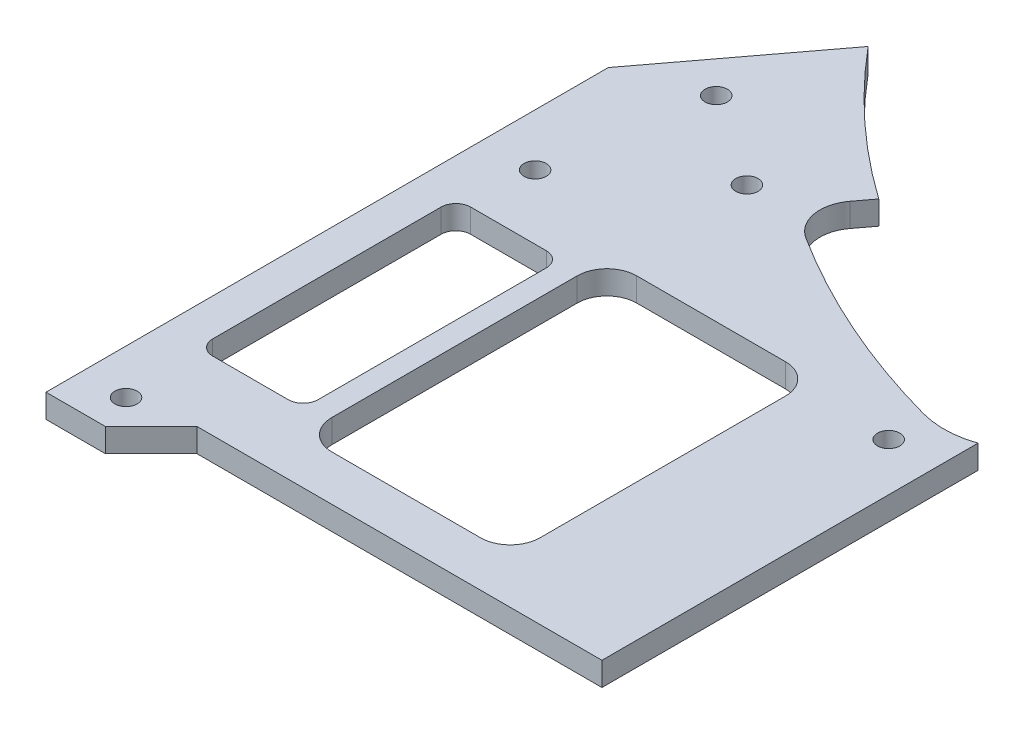
ISO-10303-21;
HEADER;
FILE_DESCRIPTION(('STEP AP214'),'2;1');
FILE_NAME('part.step','',(''),(''),'','','');
FILE_SCHEMA(('AUTOMOTIVE_DESIGN { 1 0 10303 214 1 1 1 1 }'));
ENDSEC;
DATA;
#1=APPLICATION_CONTEXT('core data for automotive mechanical design processes');
#2=APPLICATION_PROTOCOL_DEFINITION('international standard','automotive_design',2000,#1);
#3=PRODUCT_CONTEXT('',#1,'mechanical');
#4=PRODUCT('Part','Part','',(#3));
#5=PRODUCT_RELATED_PRODUCT_CATEGORY('part','',(#4));
#6=PRODUCT_DEFINITION_FORMATION('','',#4);
#7=PRODUCT_DEFINITION_CONTEXT('part definition',#1,'design');
#8=PRODUCT_DEFINITION('design','',#6,#7);
#9=PRODUCT_DEFINITION_SHAPE('','',#8);
#10=(LENGTH_UNIT() NAMED_UNIT(*) SI_UNIT(.MILLI.,.METRE.));
#11=(NAMED_UNIT(*) PLANE_ANGLE_UNIT() SI_UNIT($,.RADIAN.));
#12=(NAMED_UNIT(*) SI_UNIT($,.STERADIAN.) SOLID_ANGLE_UNIT());
#13=UNCERTAINTY_MEASURE_WITH_UNIT(LENGTH_MEASURE(1.E-05),#10,'distance_accuracy_value','');
#14=(GEOMETRIC_REPRESENTATION_CONTEXT(3) GLOBAL_UNCERTAINTY_ASSIGNED_CONTEXT((#13)) GLOBAL_UNIT_ASSIGNED_CONTEXT((#10,
#11,#12)) REPRESENTATION_CONTEXT('',''));
#15=CARTESIAN_POINT('',(0.,0.,0.));
#16=DIRECTION('',(0.,0.,1.));
#17=DIRECTION('',(1.,0.,0.));
#18=AXIS2_PLACEMENT_3D('',#15,#16,#17);
#19=CARTESIAN_POINT('',(0.,36.,0.));
#20=DIRECTION('',(0.,1.,0.));
#21=DIRECTION('',(0.,0.,1.));
#22=AXIS2_PLACEMENT_3D('',#19,#20,#21);
#23=PLANE('',#22);
#24=DIRECTION('',(0.,0.,1.));
#25=VECTOR('',#24,1.);
#26=CARTESIAN_POINT('',(-20.5761915158073,36.,-84.0401600450592));
#27=LINE('',#26,#25);
#28=CARTESIAN_POINT('',(-20.5761915158073,36.,100.640470308775));
#29=VERTEX_POINT('',#28);
#30=CARTESIAN_POINT('',(-20.5761915158073,36.,151.2));
#31=VERTEX_POINT('',#30);
#32=EDGE_CURVE('E219',#29,#31,#27,.T.);
#33=ORIENTED_EDGE('',*,*,#32,.F.);
#34=CARTESIAN_POINT('',(-24.5,36.,89.3001119820127));
#35=DIRECTION('',(0.,1.,0.));
#36=DIRECTION('',(0.,0.,-1.));
#37=AXIS2_PLACEMENT_3D('',#34,#35,#36);
#38=CIRCLE('',#37,12.);
#39=CARTESIAN_POINT('',(-27.6749460043196,36.,100.872480705383));
#40=VERTEX_POINT('',#39);
#41=EDGE_CURVE('E230',#40,#29,#38,.T.);
#42=ORIENTED_EDGE('',*,*,#41,.F.);
#43=CARTESIAN_POINT('',(4.66779392915839E-11,36.,-1.10508824313627E-10));
#44=DIRECTION('',(0.,1.,0.));
#45=DIRECTION('',(0.,0.,1.));
#46=AXIS2_PLACEMENT_3D('',#43,#44,#45);
#47=CIRCLE('',#46,104.600000000119);
#48=CARTESIAN_POINT('',(-56.0366408541975,36.,88.3235805534269));
#49=VERTEX_POINT('',#48);
#50=EDGE_CURVE('E239',#49,#40,#47,.T.);
#51=ORIENTED_EDGE('',*,*,#50,.F.);
#52=CARTESIAN_POINT('',(-53.3580251345896,36.,84.1016120757296));
#53=DIRECTION('',(0.,1.,0.));
#54=DIRECTION('',(0.,0.,1.));
#55=AXIS2_PLACEMENT_3D('',#52,#53,#54);
#56=CIRCLE('',#55,5.);
#57=CARTESIAN_POINT('',(-57.3512026848261,36.,81.0925369599694));
#58=VERTEX_POINT('',#57);
#59=EDGE_CURVE('E245',#58,#49,#56,.T.);
#60=ORIENTED_EDGE('',*,*,#59,.F.);
#61=DIRECTION('',(-0.601815023152044,0.,0.798635510047296));
#62=VECTOR('',#61,1.);
#63=CARTESIAN_POINT('',(-21.4931775502365,36.,33.5073303915772));
#64=LINE('',#63,#62);
#65=CARTESIAN_POINT('',(-55.6815943466689,36.,78.8768918606836));
#66=VERTEX_POINT('',#65);
#67=EDGE_CURVE('E263',#66,#58,#64,.T.);
#68=ORIENTED_EDGE('',*,*,#67,.F.);
#69=CARTESIAN_POINT('',(0.,36.,0.));
#70=DIRECTION('',(0.,1.,0.));
#71=DIRECTION('',(0.,0.,1.));
#72=AXIS2_PLACEMENT_3D('',#69,#70,#71);
#73=CIRCLE('',#72,96.550525729221);
#74=CARTESIAN_POINT('',(-74.1470081851936,36.,61.8403201461135));
#75=VERTEX_POINT('',#74);
#76=EDGE_CURVE('E64',#75,#66,#73,.T.);
#77=ORIENTED_EDGE('',*,*,#76,.F.);
#78=DIRECTION('',(-0.601815023152044,0.,0.798635510047296));
#79=VECTOR('',#78,1.);
#80=CARTESIAN_POINT('',(-17.5699812210405,36.,-13.239930509345));
#81=LINE('',#80,#79);
#82=CARTESIAN_POINT('',(-89.1600000000001,36.,81.7632331909823));
#83=VERTEX_POINT('',#82);
#84=EDGE_CURVE('E304',#75,#83,#81,.T.);
#85=ORIENTED_EDGE('',*,*,#84,.T.);
#86=DIRECTION('',(0.,0.,1.));
#87=VECTOR('',#86,1.);
#88=CARTESIAN_POINT('',(-89.1600000000001,36.,81.7632331909823));
#89=LINE('',#88,#87);
#90=CARTESIAN_POINT('',(-89.1600000000001,36.,157.357359312881));
#91=VERTEX_POINT('',#90);
#92=EDGE_CURVE('E307',#83,#91,#89,.T.);
#93=ORIENTED_EDGE('',*,*,#92,.T.);
#94=DIRECTION('',(1.,0.,0.));
#95=VECTOR('',#94,1.);
#96=CARTESIAN_POINT('',(-89.1600000000001,36.,157.357359312881));
#97=LINE('',#96,#95);
#98=CARTESIAN_POINT('',(-81.1894372515229,36.,157.357359312881));
#99=VERTEX_POINT('',#98);
#100=EDGE_CURVE('E311',#91,#99,#97,.T.);
#101=ORIENTED_EDGE('',*,*,#100,.T.);
#102=DIRECTION('',(0.707106781186546,0.,-0.707106781186549));
#103=VECTOR('',#102,1.);
#104=CARTESIAN_POINT('',(-81.1894372515229,36.,157.357359312881));
#105=LINE('',#104,#103);
#106=CARTESIAN_POINT('',(-75.0320779386422,36.,151.2));
#107=VERTEX_POINT('',#106);
#108=EDGE_CURVE('E314',#99,#107,#105,.T.);
#109=ORIENTED_EDGE('',*,*,#108,.T.);
#110=DIRECTION('',(1.,0.,0.));
#111=VECTOR('',#110,1.);
#112=CARTESIAN_POINT('',(-75.0320779386422,36.,151.2));
#113=LINE('',#112,#111);
#114=EDGE_CURVE('E232',#107,#31,#113,.T.);
#115=ORIENTED_EDGE('',*,*,#114,.T.);
#116=EDGE_LOOP('',(#33,#42,#51,#60,#68,#77,#85,#93,#101,#109,#115));
#117=FACE_BOUND('',#116,.T.);
#118=CARTESIAN_POINT('',(-82.16,36.,98.6));
#119=DIRECTION('',(0.,1.,0.));
#120=DIRECTION('',(0.,0.,1.));
#121=AXIS2_PLACEMENT_3D('',#118,#119,#120);
#122=CIRCLE('',#121,1.5);
#123=CARTESIAN_POINT('',(-82.16,36.,100.1));
#124=VERTEX_POINT('',#123);
#125=EDGE_CURVE('E577',#124,#124,#122,.T.);
#126=ORIENTED_EDGE('',*,*,#125,.F.);
#127=EDGE_LOOP('',(#126));
#128=FACE_BOUND('',#127,.T.);
#129=CARTESIAN_POINT('',(-66.171704332278,36.,86.1119361398964));
#130=DIRECTION('',(0.,1.,0.));
#131=DIRECTION('',(0.,0.,1.));
#132=AXIS2_PLACEMENT_3D('',#129,#130,#131);
#133=CIRCLE('',#132,1.5);
#134=CARTESIAN_POINT('',(-66.171704332278,36.,87.6119361398964));
#135=VERTEX_POINT('',#134);
#136=EDGE_CURVE('E572',#135,#135,#133,.T.);
#137=ORIENTED_EDGE('',*,*,#136,.F.);
#138=EDGE_LOOP('',(#137));
#139=FACE_BOUND('',#138,.T.);
#140=DIRECTION('',(0.,0.,1.));
#141=VECTOR('',#140,1.);
#142=CARTESIAN_POINT('',(-67.,36.,104.1));
#143=LINE('',#142,#141);
#144=CARTESIAN_POINT('',(-67.,36.,108.1));
#145=VERTEX_POINT('',#144);
#146=CARTESIAN_POINT('',(-67.,36.,141.1));
#147=VERTEX_POINT('',#146);
#148=EDGE_CURVE('E478',#145,#147,#143,.T.);
#149=ORIENTED_EDGE('',*,*,#148,.F.);
#150=CARTESIAN_POINT('',(-63.,36.,108.1));
#151=DIRECTION('',(0.,1.,0.));
#152=DIRECTION('',(0.,0.,1.));
#153=AXIS2_PLACEMENT_3D('',#150,#151,#152);
#154=CIRCLE('',#153,4.);
#155=CARTESIAN_POINT('',(-63.,36.,104.1));
#156=VERTEX_POINT('',#155);
#157=EDGE_CURVE('E447',#145,#156,#154,.F.);
#158=ORIENTED_EDGE('',*,*,#157,.T.);
#159=DIRECTION('',(-1.,0.,0.));
#160=VECTOR('',#159,1.);
#161=CARTESIAN_POINT('',(-67.,36.,104.1));
#162=LINE('',#161,#160);
#163=CARTESIAN_POINT('',(-43.,36.,104.1));
#164=VERTEX_POINT('',#163);
#165=EDGE_CURVE('E472',#164,#156,#162,.T.);
#166=ORIENTED_EDGE('',*,*,#165,.F.);
#167=CARTESIAN_POINT('',(-43.,36.,108.1));
#168=DIRECTION('',(0.,1.,0.));
#169=DIRECTION('',(0.,0.,1.));
#170=AXIS2_PLACEMENT_3D('',#167,#168,#169);
#171=CIRCLE('',#170,4.);
#172=CARTESIAN_POINT('',(-39.,36.,108.1));
#173=VERTEX_POINT('',#172);
#174=EDGE_CURVE('E441',#164,#173,#171,.F.);
#175=ORIENTED_EDGE('',*,*,#174,.T.);
#176=DIRECTION('',(0.,0.,-1.));
#177=VECTOR('',#176,1.);
#178=CARTESIAN_POINT('',(-39.,36.,104.1));
#179=LINE('',#178,#177);
#180=CARTESIAN_POINT('',(-39.,36.,141.1));
#181=VERTEX_POINT('',#180);
#182=EDGE_CURVE('E483',#181,#173,#179,.T.);
#183=ORIENTED_EDGE('',*,*,#182,.F.);
#184=CARTESIAN_POINT('',(-43.,36.,141.1));
#185=DIRECTION('',(0.,1.,0.));
#186=DIRECTION('',(0.,0.,1.));
#187=AXIS2_PLACEMENT_3D('',#184,#185,#186);
#188=CIRCLE('',#187,4.);
#189=CARTESIAN_POINT('',(-43.,36.,145.1));
#190=VERTEX_POINT('',#189);
#191=EDGE_CURVE('E429',#181,#190,#188,.F.);
#192=ORIENTED_EDGE('',*,*,#191,.T.);
#193=DIRECTION('',(1.,0.,0.));
#194=VECTOR('',#193,1.);
#195=CARTESIAN_POINT('',(-67.,36.,145.1));
#196=LINE('',#195,#194);
#197=CARTESIAN_POINT('',(-63.,36.,145.1));
#198=VERTEX_POINT('',#197);
#199=EDGE_CURVE('E487',#198,#190,#196,.T.);
#200=ORIENTED_EDGE('',*,*,#199,.F.);
#201=CARTESIAN_POINT('',(-63.,36.,141.1));
#202=DIRECTION('',(0.,1.,0.));
#203=DIRECTION('',(0.,0.,1.));
#204=AXIS2_PLACEMENT_3D('',#201,#202,#203);
#205=CIRCLE('',#204,4.);
#206=EDGE_CURVE('E435',#198,#147,#205,.F.);
#207=ORIENTED_EDGE('',*,*,#206,.T.);
#208=EDGE_LOOP('',(#149,#158,#166,#175,#183,#192,#200,#207));
#209=FACE_BOUND('',#208,.T.);
#210=CARTESIAN_POINT('',(-78.6387322233556,36.,77.7708801178395));
#211=DIRECTION('',(0.,1.,0.));
#212=DIRECTION('',(0.,0.,1.));
#213=AXIS2_PLACEMENT_3D('',#210,#211,#212);
#214=CIRCLE('',#213,1.5);
#215=CARTESIAN_POINT('',(-78.6387322233556,36.,79.2708801178395));
#216=VERTEX_POINT('',#215);
#217=EDGE_CURVE('E496',#216,#216,#214,.T.);
#218=ORIENTED_EDGE('',*,*,#217,.F.);
#219=EDGE_LOOP('',(#218));
#220=FACE_BOUND('',#219,.T.);
#221=CARTESIAN_POINT('',(-83.1600000000001,36.,152.6));
#222=DIRECTION('',(0.,1.,0.));
#223=DIRECTION('',(0.,0.,1.));
#224=AXIS2_PLACEMENT_3D('',#221,#222,#223);
#225=CIRCLE('',#224,1.5);
#226=CARTESIAN_POINT('',(-83.1600000000001,36.,154.1));
#227=VERTEX_POINT('',#226);
#228=EDGE_CURVE('E495',#227,#227,#225,.T.);
#229=ORIENTED_EDGE('',*,*,#228,.F.);
#230=EDGE_LOOP('',(#229));
#231=FACE_BOUND('',#230,.T.);
#232=CARTESIAN_POINT('',(-27.,36.,106.222219897722));
#233=DIRECTION('',(0.,1.,0.));
#234=DIRECTION('',(0.,0.,1.));
#235=AXIS2_PLACEMENT_3D('',#232,#233,#234);
#236=CIRCLE('',#235,1.5);
#237=CARTESIAN_POINT('',(-27.,36.,107.722219897722));
#238=VERTEX_POINT('',#237);
#239=EDGE_CURVE('E503',#238,#238,#236,.T.);
#240=ORIENTED_EDGE('',*,*,#239,.F.);
#241=EDGE_LOOP('',(#240));
#242=FACE_BOUND('',#241,.T.);
#243=DIRECTION('',(1.,0.,0.));
#244=VECTOR('',#243,1.);
#245=CARTESIAN_POINT('',(-84.16,36.,141.946640511851));
#246=LINE('',#245,#244);
#247=CARTESIAN_POINT('',(-82.16,36.,141.946640511851));
#248=VERTEX_POINT('',#247);
#249=CARTESIAN_POINT('',(-72.,36.,141.946640511851));
#250=VERTEX_POINT('',#249);
#251=EDGE_CURVE('E276',#248,#250,#246,.T.);
#252=ORIENTED_EDGE('',*,*,#251,.F.);
#253=CARTESIAN_POINT('',(-82.16,36.,139.946640511851));
#254=DIRECTION('',(0.,1.,0.));
#255=DIRECTION('',(0.,0.,1.));
#256=AXIS2_PLACEMENT_3D('',#253,#254,#255);
#257=CIRCLE('',#256,2.);
#258=CARTESIAN_POINT('',(-84.16,36.,139.946640511851));
#259=VERTEX_POINT('',#258);
#260=EDGE_CURVE('E386',#248,#259,#257,.F.);
#261=ORIENTED_EDGE('',*,*,#260,.T.);
#262=DIRECTION('',(0.,0.,1.));
#263=VECTOR('',#262,1.);
#264=CARTESIAN_POINT('',(-84.16,36.,107.253359488149));
#265=LINE('',#264,#263);
#266=CARTESIAN_POINT('',(-84.16,36.,109.253359488149));
#267=VERTEX_POINT('',#266);
#268=EDGE_CURVE('E272',#267,#259,#265,.T.);
#269=ORIENTED_EDGE('',*,*,#268,.F.);
#270=CARTESIAN_POINT('',(-82.16,36.,109.253359488149));
#271=DIRECTION('',(0.,1.,0.));
#272=DIRECTION('',(0.,0.,1.));
#273=AXIS2_PLACEMENT_3D('',#270,#271,#272);
#274=CIRCLE('',#273,2.);
#275=CARTESIAN_POINT('',(-82.16,36.,107.253359488149));
#276=VERTEX_POINT('',#275);
#277=EDGE_CURVE('E392',#267,#276,#274,.F.);
#278=ORIENTED_EDGE('',*,*,#277,.T.);
#279=DIRECTION('',(-1.,0.,0.));
#280=VECTOR('',#279,1.);
#281=CARTESIAN_POINT('',(-70.,36.,107.253359488149));
#282=LINE('',#281,#280);
#283=CARTESIAN_POINT('',(-72.,36.,107.253359488149));
#284=VERTEX_POINT('',#283);
#285=EDGE_CURVE('E285',#284,#276,#282,.T.);
#286=ORIENTED_EDGE('',*,*,#285,.F.);
#287=CARTESIAN_POINT('',(-72.,36.,109.253359488149));
#288=DIRECTION('',(0.,1.,0.));
#289=DIRECTION('',(0.,0.,1.));
#290=AXIS2_PLACEMENT_3D('',#287,#288,#289);
#291=CIRCLE('',#290,2.);
#292=CARTESIAN_POINT('',(-70.,36.,109.253359488149));
#293=VERTEX_POINT('',#292);
#294=EDGE_CURVE('E398',#284,#293,#291,.F.);
#295=ORIENTED_EDGE('',*,*,#294,.T.);
#296=DIRECTION('',(0.,0.,-1.));
#297=VECTOR('',#296,1.);
#298=CARTESIAN_POINT('',(-70.,36.,141.946640511851));
#299=LINE('',#298,#297);
#300=CARTESIAN_POINT('',(-70.,36.,139.946640511851));
#301=VERTEX_POINT('',#300);
#302=EDGE_CURVE('E281',#301,#293,#299,.T.);
#303=ORIENTED_EDGE('',*,*,#302,.F.);
#304=CARTESIAN_POINT('',(-72.,36.,139.946640511851));
#305=DIRECTION('',(0.,1.,0.));
#306=DIRECTION('',(0.,0.,1.));
#307=AXIS2_PLACEMENT_3D('',#304,#305,#306);
#308=CIRCLE('',#307,2.);
#309=EDGE_CURVE('E380',#301,#250,#308,.F.);
#310=ORIENTED_EDGE('',*,*,#309,.T.);
#311=EDGE_LOOP('',(#252,#261,#269,#278,#286,#295,#303,#310));
#312=FACE_BOUND('',#311,.T.);
#313=ADVANCED_FACE('F41',(#117,#128,#139,#209,#220,#231,#242,#312),#23,.T.);
#314=CARTESIAN_POINT('',(0.,32.825,0.));
#315=DIRECTION('',(0.,1.,0.));
#316=DIRECTION('',(0.,0.,1.));
#317=AXIS2_PLACEMENT_3D('',#314,#315,#316);
#318=PLANE('',#317);
#319=CARTESIAN_POINT('',(-82.16,32.825,98.6));
#320=DIRECTION('',(0.,1.,0.));
#321=DIRECTION('',(0.,0.,1.));
#322=AXIS2_PLACEMENT_3D('',#319,#320,#321);
#323=CIRCLE('',#322,1.5);
#324=CARTESIAN_POINT('',(-82.16,32.825,100.1));
#325=VERTEX_POINT('',#324);
#326=EDGE_CURVE('E573',#325,#325,#323,.T.);
#327=ORIENTED_EDGE('',*,*,#326,.T.);
#328=EDGE_LOOP('',(#327));
#329=FACE_BOUND('',#328,.T.);
#330=CARTESIAN_POINT('',(-66.171704332278,32.825,86.1119361398964));
#331=DIRECTION('',(0.,1.,0.));
#332=DIRECTION('',(0.,0.,1.));
#333=AXIS2_PLACEMENT_3D('',#330,#331,#332);
#334=CIRCLE('',#333,1.5);
#335=CARTESIAN_POINT('',(-66.171704332278,32.825,87.6119361398964));
#336=VERTEX_POINT('',#335);
#337=EDGE_CURVE('E581',#336,#336,#334,.T.);
#338=ORIENTED_EDGE('',*,*,#337,.T.);
#339=EDGE_LOOP('',(#338));
#340=FACE_BOUND('',#339,.T.);
#341=DIRECTION('',(0.,0.,-1.));
#342=VECTOR('',#341,1.);
#343=CARTESIAN_POINT('',(-39.,32.825,104.1));
#344=LINE('',#343,#342);
#345=CARTESIAN_POINT('',(-39.,32.825,141.1));
#346=VERTEX_POINT('',#345);
#347=CARTESIAN_POINT('',(-39.,32.825,108.1));
#348=VERTEX_POINT('',#347);
#349=EDGE_CURVE('E591',#346,#348,#344,.T.);
#350=ORIENTED_EDGE('',*,*,#349,.T.);
#351=CARTESIAN_POINT('',(-43.,32.825,108.1));
#352=DIRECTION('',(0.,1.,0.));
#353=DIRECTION('',(0.,0.,1.));
#354=AXIS2_PLACEMENT_3D('',#351,#352,#353);
#355=CIRCLE('',#354,4.);
#356=CARTESIAN_POINT('',(-43.,32.825,104.1));
#357=VERTEX_POINT('',#356);
#358=EDGE_CURVE('E444',#348,#357,#355,.T.);
#359=ORIENTED_EDGE('',*,*,#358,.T.);
#360=DIRECTION('',(-1.,0.,0.));
#361=VECTOR('',#360,1.);
#362=CARTESIAN_POINT('',(-67.,32.825,104.1));
#363=LINE('',#362,#361);
#364=CARTESIAN_POINT('',(-63.,32.825,104.1));
#365=VERTEX_POINT('',#364);
#366=EDGE_CURVE('E461',#357,#365,#363,.T.);
#367=ORIENTED_EDGE('',*,*,#366,.T.);
#368=CARTESIAN_POINT('',(-63.,32.825,108.1));
#369=DIRECTION('',(0.,1.,0.));
#370=DIRECTION('',(0.,0.,1.));
#371=AXIS2_PLACEMENT_3D('',#368,#369,#370);
#372=CIRCLE('',#371,4.);
#373=CARTESIAN_POINT('',(-67.,32.825,108.1));
#374=VERTEX_POINT('',#373);
#375=EDGE_CURVE('E50',#365,#374,#372,.T.);
#376=ORIENTED_EDGE('',*,*,#375,.T.);
#377=DIRECTION('',(0.,0.,1.));
#378=VECTOR('',#377,1.);
#379=CARTESIAN_POINT('',(-67.,32.825,104.1));
#380=LINE('',#379,#378);
#381=CARTESIAN_POINT('',(-67.,32.825,141.1));
#382=VERTEX_POINT('',#381);
#383=EDGE_CURVE('E458',#374,#382,#380,.T.);
#384=ORIENTED_EDGE('',*,*,#383,.T.);
#385=CARTESIAN_POINT('',(-63.,32.825,141.1));
#386=DIRECTION('',(0.,1.,0.));
#387=DIRECTION('',(0.,0.,1.));
#388=AXIS2_PLACEMENT_3D('',#385,#386,#387);
#389=CIRCLE('',#388,4.);
#390=CARTESIAN_POINT('',(-63.,32.825,145.1));
#391=VERTEX_POINT('',#390);
#392=EDGE_CURVE('E438',#382,#391,#389,.T.);
#393=ORIENTED_EDGE('',*,*,#392,.T.);
#394=DIRECTION('',(1.,0.,0.));
#395=VECTOR('',#394,1.);
#396=CARTESIAN_POINT('',(-67.,32.825,145.1));
#397=LINE('',#396,#395);
#398=CARTESIAN_POINT('',(-43.,32.825,145.1));
#399=VERTEX_POINT('',#398);
#400=EDGE_CURVE('E471',#391,#399,#397,.T.);
#401=ORIENTED_EDGE('',*,*,#400,.T.);
#402=CARTESIAN_POINT('',(-43.,32.825,141.1));
#403=DIRECTION('',(0.,1.,0.));
#404=DIRECTION('',(0.,0.,1.));
#405=AXIS2_PLACEMENT_3D('',#402,#403,#404);
#406=CIRCLE('',#405,4.);
#407=EDGE_CURVE('E432',#399,#346,#406,.T.);
#408=ORIENTED_EDGE('',*,*,#407,.T.);
#409=EDGE_LOOP('',(#350,#359,#367,#376,#384,#393,#401,#408));
#410=FACE_BOUND('',#409,.T.);
#411=CARTESIAN_POINT('',(-78.6387322233556,32.825,77.7708801178395));
#412=DIRECTION('',(0.,1.,0.));
#413=DIRECTION('',(0.,0.,1.));
#414=AXIS2_PLACEMENT_3D('',#411,#412,#413);
#415=CIRCLE('',#414,1.5);
#416=CARTESIAN_POINT('',(-78.6387322233556,32.825,79.2708801178395));
#417=VERTEX_POINT('',#416);
#418=EDGE_CURVE('E491',#417,#417,#415,.T.);
#419=ORIENTED_EDGE('',*,*,#418,.T.);
#420=EDGE_LOOP('',(#419));
#421=FACE_BOUND('',#420,.T.);
#422=CARTESIAN_POINT('',(-83.1600000000001,32.825,152.6));
#423=DIRECTION('',(0.,1.,0.));
#424=DIRECTION('',(0.,0.,1.));
#425=AXIS2_PLACEMENT_3D('',#422,#423,#424);
#426=CIRCLE('',#425,1.5);
#427=CARTESIAN_POINT('',(-83.1600000000001,32.825,154.1));
#428=VERTEX_POINT('',#427);
#429=EDGE_CURVE('E507',#428,#428,#426,.T.);
#430=ORIENTED_EDGE('',*,*,#429,.T.);
#431=EDGE_LOOP('',(#430));
#432=FACE_BOUND('',#431,.T.);
#433=CARTESIAN_POINT('',(-27.,32.825,106.222219897722));
#434=DIRECTION('',(0.,1.,0.));
#435=DIRECTION('',(0.,0.,1.));
#436=AXIS2_PLACEMENT_3D('',#433,#434,#435);
#437=CIRCLE('',#436,1.5);
#438=CARTESIAN_POINT('',(-27.,32.825,107.722219897722));
#439=VERTEX_POINT('',#438);
#440=EDGE_CURVE('E253',#439,#439,#437,.T.);
#441=ORIENTED_EDGE('',*,*,#440,.T.);
#442=EDGE_LOOP('',(#441));
#443=FACE_BOUND('',#442,.T.);
#444=DIRECTION('',(-1.,0.,0.));
#445=VECTOR('',#444,1.);
#446=CARTESIAN_POINT('',(-70.,32.825,107.253359488149));
#447=LINE('',#446,#445);
#448=CARTESIAN_POINT('',(-72.,32.825,107.253359488149));
#449=VERTEX_POINT('',#448);
#450=CARTESIAN_POINT('',(-82.16,32.825,107.253359488149));
#451=VERTEX_POINT('',#450);
#452=EDGE_CURVE('E277',#449,#451,#447,.T.);
#453=ORIENTED_EDGE('',*,*,#452,.T.);
#454=CARTESIAN_POINT('',(-82.16,32.825,109.253359488149));
#455=DIRECTION('',(0.,1.,0.));
#456=DIRECTION('',(0.,0.,1.));
#457=AXIS2_PLACEMENT_3D('',#454,#455,#456);
#458=CIRCLE('',#457,2.);
#459=CARTESIAN_POINT('',(-84.16,32.825,109.253359488149));
#460=VERTEX_POINT('',#459);
#461=EDGE_CURVE('E389',#451,#460,#458,.T.);
#462=ORIENTED_EDGE('',*,*,#461,.T.);
#463=DIRECTION('',(0.,0.,1.));
#464=VECTOR('',#463,1.);
#465=CARTESIAN_POINT('',(-84.16,32.825,107.253359488149));
#466=LINE('',#465,#464);
#467=CARTESIAN_POINT('',(-84.16,32.825,139.946640511851));
#468=VERTEX_POINT('',#467);
#469=EDGE_CURVE('E271',#460,#468,#466,.T.);
#470=ORIENTED_EDGE('',*,*,#469,.T.);
#471=CARTESIAN_POINT('',(-82.16,32.825,139.946640511851));
#472=DIRECTION('',(0.,1.,0.));
#473=DIRECTION('',(0.,0.,1.));
#474=AXIS2_PLACEMENT_3D('',#471,#472,#473);
#475=CIRCLE('',#474,2.);
#476=CARTESIAN_POINT('',(-82.16,32.825,141.946640511851));
#477=VERTEX_POINT('',#476);
#478=EDGE_CURVE('E383',#468,#477,#475,.T.);
#479=ORIENTED_EDGE('',*,*,#478,.T.);
#480=DIRECTION('',(1.,0.,0.));
#481=VECTOR('',#480,1.);
#482=CARTESIAN_POINT('',(-84.16,32.825,141.946640511851));
#483=LINE('',#482,#481);
#484=CARTESIAN_POINT('',(-72.,32.825,141.946640511851));
#485=VERTEX_POINT('',#484);
#486=EDGE_CURVE('E293',#477,#485,#483,.T.);
#487=ORIENTED_EDGE('',*,*,#486,.T.);
#488=CARTESIAN_POINT('',(-72.,32.825,139.946640511851));
#489=DIRECTION('',(0.,1.,0.));
#490=DIRECTION('',(0.,0.,1.));
#491=AXIS2_PLACEMENT_3D('',#488,#489,#490);
#492=CIRCLE('',#491,2.);
#493=CARTESIAN_POINT('',(-70.,32.825,139.946640511851));
#494=VERTEX_POINT('',#493);
#495=EDGE_CURVE('E377',#485,#494,#492,.T.);
#496=ORIENTED_EDGE('',*,*,#495,.T.);
#497=DIRECTION('',(0.,0.,-1.));
#498=VECTOR('',#497,1.);
#499=CARTESIAN_POINT('',(-70.,32.825,141.946640511851));
#500=LINE('',#499,#498);
#501=CARTESIAN_POINT('',(-70.,32.825,109.253359488149));
#502=VERTEX_POINT('',#501);
#503=EDGE_CURVE('E297',#494,#502,#500,.T.);
#504=ORIENTED_EDGE('',*,*,#503,.T.);
#505=CARTESIAN_POINT('',(-72.,32.825,109.253359488149));
#506=DIRECTION('',(0.,1.,0.));
#507=DIRECTION('',(0.,0.,1.));
#508=AXIS2_PLACEMENT_3D('',#505,#506,#507);
#509=CIRCLE('',#508,2.);
#510=EDGE_CURVE('E395',#502,#449,#509,.T.);
#511=ORIENTED_EDGE('',*,*,#510,.T.);
#512=EDGE_LOOP('',(#453,#462,#470,#479,#487,#496,#504,#511));
#513=FACE_BOUND('',#512,.T.);
#514=CARTESIAN_POINT('',(-24.5,32.825,89.3001119820127));
#515=DIRECTION('',(0.,1.,0.));
#516=DIRECTION('',(0.,0.,-1.));
#517=AXIS2_PLACEMENT_3D('',#514,#515,#516);
#518=CIRCLE('',#517,12.);
#519=CARTESIAN_POINT('',(-27.6749460043196,32.825,100.872480705383));
#520=VERTEX_POINT('',#519);
#521=CARTESIAN_POINT('',(-20.5761915158073,32.825,100.640470308775));
#522=VERTEX_POINT('',#521);
#523=EDGE_CURVE('E261',#520,#522,#518,.T.);
#524=ORIENTED_EDGE('',*,*,#523,.T.);
#525=DIRECTION('',(0.,0.,1.));
#526=VECTOR('',#525,1.);
#527=CARTESIAN_POINT('',(-20.5761915158073,32.825,-84.0401600450592));
#528=LINE('',#527,#526);
#529=CARTESIAN_POINT('',(-20.5761915158073,32.825,151.2));
#530=VERTEX_POINT('',#529);
#531=EDGE_CURVE('E56',#522,#530,#528,.T.);
#532=ORIENTED_EDGE('',*,*,#531,.T.);
#533=DIRECTION('',(1.,0.,0.));
#534=VECTOR('',#533,1.);
#535=CARTESIAN_POINT('',(-75.0320779386422,32.825,151.2));
#536=LINE('',#535,#534);
#537=CARTESIAN_POINT('',(-75.0320779386422,32.825,151.2));
#538=VERTEX_POINT('',#537);
#539=EDGE_CURVE('E308',#538,#530,#536,.T.);
#540=ORIENTED_EDGE('',*,*,#539,.F.);
#541=DIRECTION('',(0.707106781186546,0.,-0.707106781186549));
#542=VECTOR('',#541,1.);
#543=CARTESIAN_POINT('',(-81.1894372515229,32.825,157.357359312881));
#544=LINE('',#543,#542);
#545=CARTESIAN_POINT('',(-81.1894372515229,32.825,157.357359312881));
#546=VERTEX_POINT('',#545);
#547=EDGE_CURVE('E328',#546,#538,#544,.T.);
#548=ORIENTED_EDGE('',*,*,#547,.F.);
#549=DIRECTION('',(1.,0.,0.));
#550=VECTOR('',#549,1.);
#551=CARTESIAN_POINT('',(-89.1600000000001,32.825,157.357359312881));
#552=LINE('',#551,#550);
#553=CARTESIAN_POINT('',(-89.1600000000001,32.825,157.357359312881));
#554=VERTEX_POINT('',#553);
#555=EDGE_CURVE('E325',#554,#546,#552,.T.);
#556=ORIENTED_EDGE('',*,*,#555,.F.);
#557=DIRECTION('',(0.,0.,1.));
#558=VECTOR('',#557,1.);
#559=CARTESIAN_POINT('',(-89.1600000000001,32.825,81.7632331909823));
#560=LINE('',#559,#558);
#561=CARTESIAN_POINT('',(-89.1600000000001,32.825,81.7632331909823));
#562=VERTEX_POINT('',#561);
#563=EDGE_CURVE('E322',#562,#554,#560,.T.);
#564=ORIENTED_EDGE('',*,*,#563,.F.);
#565=DIRECTION('',(-0.601815023152044,0.,0.798635510047296));
#566=VECTOR('',#565,1.);
#567=CARTESIAN_POINT('',(-17.5699812210405,32.825,-13.239930509345));
#568=LINE('',#567,#566);
#569=CARTESIAN_POINT('',(-74.1470081851936,32.825,61.8403201461135));
#570=VERTEX_POINT('',#569);
#571=EDGE_CURVE('E289',#570,#562,#568,.T.);
#572=ORIENTED_EDGE('',*,*,#571,.F.);
#573=CARTESIAN_POINT('',(0.,32.825,0.));
#574=DIRECTION('',(0.,1.,0.));
#575=DIRECTION('',(0.,0.,1.));
#576=AXIS2_PLACEMENT_3D('',#573,#574,#575);
#577=CIRCLE('',#576,96.550525729221);
#578=CARTESIAN_POINT('',(-55.6815943466689,32.825,78.8768918606836));
#579=VERTEX_POINT('',#578);
#580=EDGE_CURVE('E530',#570,#579,#577,.T.);
#581=ORIENTED_EDGE('',*,*,#580,.T.);
#582=DIRECTION('',(-0.601815023152044,0.,0.798635510047296));
#583=VECTOR('',#582,1.);
#584=CARTESIAN_POINT('',(-21.4931775502365,32.825,33.5073303915772));
#585=LINE('',#584,#583);
#586=CARTESIAN_POINT('',(-57.3512026848261,32.825,81.0925369599694));
#587=VERTEX_POINT('',#586);
#588=EDGE_CURVE('E249',#579,#587,#585,.T.);
#589=ORIENTED_EDGE('',*,*,#588,.T.);
#590=CARTESIAN_POINT('',(-53.3580251345896,32.825,84.1016120757296));
#591=DIRECTION('',(0.,1.,0.));
#592=DIRECTION('',(0.,0.,1.));
#593=AXIS2_PLACEMENT_3D('',#590,#591,#592);
#594=CIRCLE('',#593,5.);
#595=CARTESIAN_POINT('',(-56.0366408541975,32.825,88.3235805534269));
#596=VERTEX_POINT('',#595);
#597=EDGE_CURVE('E252',#587,#596,#594,.T.);
#598=ORIENTED_EDGE('',*,*,#597,.T.);
#599=CARTESIAN_POINT('',(4.66779392915839E-11,32.825,-1.10508824313627E-10));
#600=DIRECTION('',(0.,1.,0.));
#601=DIRECTION('',(0.,0.,1.));
#602=AXIS2_PLACEMENT_3D('',#599,#600,#601);
#603=CIRCLE('',#602,104.600000000119);
#604=EDGE_CURVE('E257',#596,#520,#603,.T.);
#605=ORIENTED_EDGE('',*,*,#604,.T.);
#606=EDGE_LOOP('',(#524,#532,#540,#548,#556,#564,#572,#581,#589,#598,#605));
#607=FACE_BOUND('',#606,.T.);
#608=ADVANCED_FACE('F456',(#329,#340,#410,#421,#432,#443,#513,#607),#318,.F.);
#609=CARTESIAN_POINT('',(-17.5699812210405,36.,-13.239930509345));
#610=DIRECTION('',(0.798635510047296,0.,0.601815023152044));
#611=DIRECTION('',(0.601815023152044,0.,-0.798635510047296));
#612=AXIS2_PLACEMENT_3D('',#609,#610,#611);
#613=PLANE('',#612);
#614=ORIENTED_EDGE('',*,*,#84,.F.);
#615=DIRECTION('',(0.,1.,0.));
#616=VECTOR('',#615,1.);
#617=CARTESIAN_POINT('',(-74.1470081851936,32.825,61.8403201461135));
#618=LINE('',#617,#616);
#619=EDGE_CURVE('E542',#75,#570,#618,.F.);
#620=ORIENTED_EDGE('',*,*,#619,.T.);
#621=ORIENTED_EDGE('',*,*,#571,.T.);
#622=DIRECTION('',(0.,-1.,0.));
#623=VECTOR('',#622,1.);
#624=CARTESIAN_POINT('',(-89.1600000000001,36.,81.7632331909823));
#625=LINE('',#624,#623);
#626=EDGE_CURVE('E345',#83,#562,#625,.T.);
#627=ORIENTED_EDGE('',*,*,#626,.F.);
#628=EDGE_LOOP('',(#614,#620,#621,#627));
#629=FACE_BOUND('',#628,.T.);
#630=ADVANCED_FACE('F541',(#629),#613,.F.);
#631=CARTESIAN_POINT('',(-89.1600000000001,36.,81.7632331909823));
#632=DIRECTION('',(1.,0.,0.));
#633=DIRECTION('',(0.,0.,-1.));
#634=AXIS2_PLACEMENT_3D('',#631,#632,#633);
#635=PLANE('',#634);
#636=ORIENTED_EDGE('',*,*,#563,.T.);
#637=DIRECTION('',(0.,-1.,0.));
#638=VECTOR('',#637,1.);
#639=CARTESIAN_POINT('',(-89.1600000000001,36.,157.357359312881));
#640=LINE('',#639,#638);
#641=EDGE_CURVE('E341',#91,#554,#640,.T.);
#642=ORIENTED_EDGE('',*,*,#641,.F.);
#643=ORIENTED_EDGE('',*,*,#92,.F.);
#644=ORIENTED_EDGE('',*,*,#626,.T.);
#645=EDGE_LOOP('',(#636,#642,#643,#644));
#646=FACE_BOUND('',#645,.T.);
#647=ADVANCED_FACE('F547',(#646),#635,.F.);
#648=CARTESIAN_POINT('',(-89.1600000000001,36.,157.357359312881));
#649=DIRECTION('',(0.,0.,-1.));
#650=DIRECTION('',(-1.,0.,0.));
#651=AXIS2_PLACEMENT_3D('',#648,#649,#650);
#652=PLANE('',#651);
#653=ORIENTED_EDGE('',*,*,#555,.T.);
#654=DIRECTION('',(0.,-1.,0.));
#655=VECTOR('',#654,1.);
#656=CARTESIAN_POINT('',(-81.1894372515229,36.,157.357359312881));
#657=LINE('',#656,#655);
#658=EDGE_CURVE('E337',#99,#546,#657,.T.);
#659=ORIENTED_EDGE('',*,*,#658,.F.);
#660=ORIENTED_EDGE('',*,*,#100,.F.);
#661=ORIENTED_EDGE('',*,*,#641,.T.);
#662=EDGE_LOOP('',(#653,#659,#660,#661));
#663=FACE_BOUND('',#662,.T.);
#664=ADVANCED_FACE('F553',(#663),#652,.F.);
#665=CARTESIAN_POINT('',(-81.1894372515229,36.,157.357359312881));
#666=DIRECTION('',(-0.707106781186549,0.,-0.707106781186546));
#667=DIRECTION('',(-0.707106781186546,0.,0.707106781186549));
#668=AXIS2_PLACEMENT_3D('',#665,#666,#667);
#669=PLANE('',#668);
#670=ORIENTED_EDGE('',*,*,#547,.T.);
#671=DIRECTION('',(0.,-1.,0.));
#672=VECTOR('',#671,1.);
#673=CARTESIAN_POINT('',(-75.0320779386422,36.,151.2));
#674=LINE('',#673,#672);
#675=EDGE_CURVE('E319',#107,#538,#674,.T.);
#676=ORIENTED_EDGE('',*,*,#675,.F.);
#677=ORIENTED_EDGE('',*,*,#108,.F.);
#678=ORIENTED_EDGE('',*,*,#658,.T.);
#679=EDGE_LOOP('',(#670,#676,#677,#678));
#680=FACE_BOUND('',#679,.T.);
#681=ADVANCED_FACE('F557',(#680),#669,.F.);
#682=CARTESIAN_POINT('',(-75.0320779386422,36.,151.2));
#683=DIRECTION('',(0.,0.,-1.));
#684=DIRECTION('',(-1.,0.,0.));
#685=AXIS2_PLACEMENT_3D('',#682,#683,#684);
#686=PLANE('',#685);
#687=ORIENTED_EDGE('',*,*,#539,.T.);
#688=DIRECTION('',(0.,1.,0.));
#689=VECTOR('',#688,1.);
#690=CARTESIAN_POINT('',(-20.5761915158073,36.,151.2));
#691=LINE('',#690,#689);
#692=EDGE_CURVE('E537',#530,#31,#691,.T.);
#693=ORIENTED_EDGE('',*,*,#692,.T.);
#694=ORIENTED_EDGE('',*,*,#114,.F.);
#695=ORIENTED_EDGE('',*,*,#675,.T.);
#696=EDGE_LOOP('',(#687,#693,#694,#695));
#697=FACE_BOUND('',#696,.T.);
#698=ADVANCED_FACE('F560',(#697),#686,.F.);
#699=CARTESIAN_POINT('',(-84.16,36.,107.253359488149));
#700=DIRECTION('',(1.,0.,0.));
#701=DIRECTION('',(0.,0.,-1.));
#702=AXIS2_PLACEMENT_3D('',#699,#700,#701);
#703=PLANE('',#702);
#704=ORIENTED_EDGE('',*,*,#268,.T.);
#705=DIRECTION('',(0.,-1.,0.));
#706=VECTOR('',#705,1.);
#707=CARTESIAN_POINT('',(-84.16,32.825,139.946640511851));
#708=LINE('',#707,#706);
#709=EDGE_CURVE('E366',#259,#468,#708,.T.);
#710=ORIENTED_EDGE('',*,*,#709,.T.);
#711=ORIENTED_EDGE('',*,*,#469,.F.);
#712=DIRECTION('',(0.,-1.,0.));
#713=VECTOR('',#712,1.);
#714=CARTESIAN_POINT('',(-84.16,36.,109.253359488149));
#715=LINE('',#714,#713);
#716=EDGE_CURVE('E363',#460,#267,#715,.F.);
#717=ORIENTED_EDGE('',*,*,#716,.T.);
#718=EDGE_LOOP('',(#704,#710,#711,#717));
#719=FACE_BOUND('',#718,.T.);
#720=ADVANCED_FACE('F634',(#719),#703,.T.);
#721=CARTESIAN_POINT('',(-84.16,36.,141.946640511851));
#722=DIRECTION('',(0.,0.,-1.));
#723=DIRECTION('',(-1.,0.,0.));
#724=AXIS2_PLACEMENT_3D('',#721,#722,#723);
#725=PLANE('',#724);
#726=ORIENTED_EDGE('',*,*,#251,.T.);
#727=DIRECTION('',(0.,-1.,0.));
#728=VECTOR('',#727,1.);
#729=CARTESIAN_POINT('',(-72.,32.825,141.946640511851));
#730=LINE('',#729,#728);
#731=EDGE_CURVE('E352',#250,#485,#730,.T.);
#732=ORIENTED_EDGE('',*,*,#731,.T.);
#733=ORIENTED_EDGE('',*,*,#486,.F.);
#734=DIRECTION('',(0.,-1.,0.));
#735=VECTOR('',#734,1.);
#736=CARTESIAN_POINT('',(-82.16,36.,141.946640511851));
#737=LINE('',#736,#735);
#738=EDGE_CURVE('E349',#477,#248,#737,.F.);
#739=ORIENTED_EDGE('',*,*,#738,.T.);
#740=EDGE_LOOP('',(#726,#732,#733,#739));
#741=FACE_BOUND('',#740,.T.);
#742=ADVANCED_FACE('F702',(#741),#725,.T.);
#743=CARTESIAN_POINT('',(-70.,36.,141.946640511851));
#744=DIRECTION('',(-1.,0.,0.));
#745=DIRECTION('',(0.,0.,1.));
#746=AXIS2_PLACEMENT_3D('',#743,#744,#745);
#747=PLANE('',#746);
#748=ORIENTED_EDGE('',*,*,#503,.F.);
#749=DIRECTION('',(0.,-1.,0.));
#750=VECTOR('',#749,1.);
#751=CARTESIAN_POINT('',(-70.,36.,139.946640511851));
#752=LINE('',#751,#750);
#753=EDGE_CURVE('E360',#494,#301,#752,.F.);
#754=ORIENTED_EDGE('',*,*,#753,.T.);
#755=ORIENTED_EDGE('',*,*,#302,.T.);
#756=DIRECTION('',(0.,-1.,0.));
#757=VECTOR('',#756,1.);
#758=CARTESIAN_POINT('',(-70.,32.825,109.253359488149));
#759=LINE('',#758,#757);
#760=EDGE_CURVE('E356',#293,#502,#759,.T.);
#761=ORIENTED_EDGE('',*,*,#760,.T.);
#762=EDGE_LOOP('',(#748,#754,#755,#761));
#763=FACE_BOUND('',#762,.T.);
#764=ADVANCED_FACE('F699',(#763),#747,.T.);
#765=CARTESIAN_POINT('',(-70.,36.,107.253359488149));
#766=DIRECTION('',(0.,0.,1.));
#767=DIRECTION('',(1.,0.,0.));
#768=AXIS2_PLACEMENT_3D('',#765,#766,#767);
#769=PLANE('',#768);
#770=ORIENTED_EDGE('',*,*,#285,.T.);
#771=DIRECTION('',(0.,-1.,0.));
#772=VECTOR('',#771,1.);
#773=CARTESIAN_POINT('',(-82.16,32.825,107.253359488149));
#774=LINE('',#773,#772);
#775=EDGE_CURVE('E373',#276,#451,#774,.T.);
#776=ORIENTED_EDGE('',*,*,#775,.T.);
#777=ORIENTED_EDGE('',*,*,#452,.F.);
#778=DIRECTION('',(0.,-1.,0.));
#779=VECTOR('',#778,1.);
#780=CARTESIAN_POINT('',(-72.,36.,107.253359488149));
#781=LINE('',#780,#779);
#782=EDGE_CURVE('E370',#449,#284,#781,.F.);
#783=ORIENTED_EDGE('',*,*,#782,.T.);
#784=EDGE_LOOP('',(#770,#776,#777,#783));
#785=FACE_BOUND('',#784,.T.);
#786=ADVANCED_FACE('F696',(#785),#769,.T.);
#787=CARTESIAN_POINT('',(-21.4931775502365,36.,33.5073303915772));
#788=DIRECTION('',(0.798635510047296,0.,0.601815023152044));
#789=DIRECTION('',(0.601815023152044,0.,-0.798635510047296));
#790=AXIS2_PLACEMENT_3D('',#787,#788,#789);
#791=PLANE('',#790);
#792=DIRECTION('',(0.,1.,0.));
#793=VECTOR('',#792,1.);
#794=CARTESIAN_POINT('',(-55.6815943466689,32.825,78.8768918606836));
#795=LINE('',#794,#793);
#796=EDGE_CURVE('E533',#66,#579,#795,.F.);
#797=ORIENTED_EDGE('',*,*,#796,.F.);
#798=ORIENTED_EDGE('',*,*,#67,.T.);
#799=DIRECTION('',(0.,-1.,0.));
#800=VECTOR('',#799,1.);
#801=CARTESIAN_POINT('',(-57.3512026848261,36.,81.0925369599694));
#802=LINE('',#801,#800);
#803=EDGE_CURVE('E267',#58,#587,#802,.T.);
#804=ORIENTED_EDGE('',*,*,#803,.T.);
#805=ORIENTED_EDGE('',*,*,#588,.F.);
#806=EDGE_LOOP('',(#797,#798,#804,#805));
#807=FACE_BOUND('',#806,.T.);
#808=ADVANCED_FACE('F532',(#807),#791,.T.);
#809=CARTESIAN_POINT('',(-53.3580251345896,36.,84.1016120757296));
#810=DIRECTION('',(0.,-1.,0.));
#811=DIRECTION('',(0.,0.,-1.));
#812=AXIS2_PLACEMENT_3D('',#809,#810,#811);
#813=CYLINDRICAL_SURFACE('',#812,5.);
#814=ORIENTED_EDGE('',*,*,#597,.F.);
#815=ORIENTED_EDGE('',*,*,#803,.F.);
#816=ORIENTED_EDGE('',*,*,#59,.T.);
#817=DIRECTION('',(0.,-1.,0.));
#818=VECTOR('',#817,1.);
#819=CARTESIAN_POINT('',(-56.0366408541975,36.,88.3235805534269));
#820=LINE('',#819,#818);
#821=EDGE_CURVE('E243',#49,#596,#820,.T.);
#822=ORIENTED_EDGE('',*,*,#821,.T.);
#823=EDGE_LOOP('',(#814,#815,#816,#822));
#824=FACE_BOUND('',#823,.T.);
#825=ADVANCED_FACE('F521',(#824),#813,.F.);
#826=CARTESIAN_POINT('',(4.66779392915839E-11,36.,-1.10508824313627E-10));
#827=DIRECTION('',(0.,-1.,0.));
#828=DIRECTION('',(0.,0.,-1.));
#829=AXIS2_PLACEMENT_3D('',#826,#827,#828);
#830=CYLINDRICAL_SURFACE('',#829,104.600000000119);
#831=ORIENTED_EDGE('',*,*,#604,.F.);
#832=ORIENTED_EDGE('',*,*,#821,.F.);
#833=ORIENTED_EDGE('',*,*,#50,.T.);
#834=DIRECTION('',(0.,-1.,0.));
#835=VECTOR('',#834,1.);
#836=CARTESIAN_POINT('',(-27.6749460043196,36.,100.872480705383));
#837=LINE('',#836,#835);
#838=EDGE_CURVE('E237',#40,#520,#837,.T.);
#839=ORIENTED_EDGE('',*,*,#838,.T.);
#840=EDGE_LOOP('',(#831,#832,#833,#839));
#841=FACE_BOUND('',#840,.T.);
#842=ADVANCED_FACE('F525',(#841),#830,.F.);
#843=CARTESIAN_POINT('',(-24.5,36.,89.3001119820127));
#844=DIRECTION('',(0.,-1.,0.));
#845=DIRECTION('',(0.,0.,-1.));
#846=AXIS2_PLACEMENT_3D('',#843,#844,#845);
#847=CYLINDRICAL_SURFACE('',#846,12.);
#848=DIRECTION('',(0.,-1.,0.));
#849=VECTOR('',#848,1.);
#850=CARTESIAN_POINT('',(-20.5761915158073,36.,100.640470308775));
#851=LINE('',#850,#849);
#852=EDGE_CURVE('E11',#522,#29,#851,.F.);
#853=ORIENTED_EDGE('',*,*,#852,.F.);
#854=ORIENTED_EDGE('',*,*,#523,.F.);
#855=ORIENTED_EDGE('',*,*,#838,.F.);
#856=ORIENTED_EDGE('',*,*,#41,.T.);
#857=EDGE_LOOP('',(#853,#854,#855,#856));
#858=FACE_BOUND('',#857,.T.);
#859=ADVANCED_FACE('F236',(#858),#847,.F.);
#860=CARTESIAN_POINT('',(-72.,36.,139.946640511851));
#861=DIRECTION('',(0.,1.,0.));
#862=DIRECTION('',(0.,0.,1.));
#863=AXIS2_PLACEMENT_3D('',#860,#861,#862);
#864=CYLINDRICAL_SURFACE('',#863,2.);
#865=ORIENTED_EDGE('',*,*,#309,.F.);
#866=ORIENTED_EDGE('',*,*,#753,.F.);
#867=ORIENTED_EDGE('',*,*,#495,.F.);
#868=ORIENTED_EDGE('',*,*,#731,.F.);
#869=EDGE_LOOP('',(#865,#866,#867,#868));
#870=FACE_BOUND('',#869,.T.);
#871=ADVANCED_FACE('F647',(#870),#864,.F.);
#872=CARTESIAN_POINT('',(-82.16,36.,139.946640511851));
#873=DIRECTION('',(0.,1.,0.));
#874=DIRECTION('',(0.,0.,1.));
#875=AXIS2_PLACEMENT_3D('',#872,#873,#874);
#876=CYLINDRICAL_SURFACE('',#875,2.);
#877=ORIENTED_EDGE('',*,*,#260,.F.);
#878=ORIENTED_EDGE('',*,*,#738,.F.);
#879=ORIENTED_EDGE('',*,*,#478,.F.);
#880=ORIENTED_EDGE('',*,*,#709,.F.);
#881=EDGE_LOOP('',(#877,#878,#879,#880));
#882=FACE_BOUND('',#881,.T.);
#883=ADVANCED_FACE('F650',(#882),#876,.F.);
#884=CARTESIAN_POINT('',(-82.16,36.,109.253359488149));
#885=DIRECTION('',(0.,1.,0.));
#886=DIRECTION('',(0.,0.,1.));
#887=AXIS2_PLACEMENT_3D('',#884,#885,#886);
#888=CYLINDRICAL_SURFACE('',#887,2.);
#889=ORIENTED_EDGE('',*,*,#277,.F.);
#890=ORIENTED_EDGE('',*,*,#716,.F.);
#891=ORIENTED_EDGE('',*,*,#461,.F.);
#892=ORIENTED_EDGE('',*,*,#775,.F.);
#893=EDGE_LOOP('',(#889,#890,#891,#892));
#894=FACE_BOUND('',#893,.T.);
#895=ADVANCED_FACE('F654',(#894),#888,.F.);
#896=CARTESIAN_POINT('',(-72.,36.,109.253359488149));
#897=DIRECTION('',(0.,1.,0.));
#898=DIRECTION('',(0.,0.,1.));
#899=AXIS2_PLACEMENT_3D('',#896,#897,#898);
#900=CYLINDRICAL_SURFACE('',#899,2.);
#901=ORIENTED_EDGE('',*,*,#294,.F.);
#902=ORIENTED_EDGE('',*,*,#782,.F.);
#903=ORIENTED_EDGE('',*,*,#510,.F.);
#904=ORIENTED_EDGE('',*,*,#760,.F.);
#905=EDGE_LOOP('',(#901,#902,#903,#904));
#906=FACE_BOUND('',#905,.T.);
#907=ADVANCED_FACE('F658',(#906),#900,.F.);
#908=CARTESIAN_POINT('',(-27.,32.825,106.222219897722));
#909=DIRECTION('',(0.,1.,0.));
#910=DIRECTION('',(0.,0.,1.));
#911=AXIS2_PLACEMENT_3D('',#908,#909,#910);
#912=CYLINDRICAL_SURFACE('',#911,1.5);
#913=ORIENTED_EDGE('',*,*,#440,.F.);
#914=EDGE_LOOP('',(#913));
#915=FACE_BOUND('',#914,.T.);
#916=ORIENTED_EDGE('',*,*,#239,.T.);
#917=EDGE_LOOP('',(#916));
#918=FACE_BOUND('',#917,.T.);
#919=ADVANCED_FACE('F662',(#915,#918),#912,.F.);
#920=CARTESIAN_POINT('',(-83.1600000000001,32.825,152.6));
#921=DIRECTION('',(0.,1.,0.));
#922=DIRECTION('',(0.,0.,1.));
#923=AXIS2_PLACEMENT_3D('',#920,#921,#922);
#924=CYLINDRICAL_SURFACE('',#923,1.5);
#925=ORIENTED_EDGE('',*,*,#429,.F.);
#926=EDGE_LOOP('',(#925));
#927=FACE_BOUND('',#926,.T.);
#928=ORIENTED_EDGE('',*,*,#228,.T.);
#929=EDGE_LOOP('',(#928));
#930=FACE_BOUND('',#929,.T.);
#931=ADVANCED_FACE('F680',(#927,#930),#924,.F.);
#932=CARTESIAN_POINT('',(-78.6387322233556,32.825,77.7708801178395));
#933=DIRECTION('',(0.,1.,0.));
#934=DIRECTION('',(0.,0.,1.));
#935=AXIS2_PLACEMENT_3D('',#932,#933,#934);
#936=CYLINDRICAL_SURFACE('',#935,1.5);
#937=ORIENTED_EDGE('',*,*,#418,.F.);
#938=EDGE_LOOP('',(#937));
#939=FACE_BOUND('',#938,.T.);
#940=ORIENTED_EDGE('',*,*,#217,.T.);
#941=EDGE_LOOP('',(#940));
#942=FACE_BOUND('',#941,.T.);
#943=ADVANCED_FACE('F677',(#939,#942),#936,.F.);
#944=CARTESIAN_POINT('',(-67.,32.825,104.1));
#945=DIRECTION('',(-1.,0.,0.));
#946=DIRECTION('',(0.,0.,1.));
#947=AXIS2_PLACEMENT_3D('',#944,#945,#946);
#948=PLANE('',#947);
#949=ORIENTED_EDGE('',*,*,#148,.T.);
#950=DIRECTION('',(0.,1.,0.));
#951=VECTOR('',#950,1.);
#952=CARTESIAN_POINT('',(-67.,32.825,141.1));
#953=LINE('',#952,#951);
#954=EDGE_CURVE('E419',#147,#382,#953,.F.);
#955=ORIENTED_EDGE('',*,*,#954,.T.);
#956=ORIENTED_EDGE('',*,*,#383,.F.);
#957=DIRECTION('',(0.,1.,0.));
#958=VECTOR('',#957,1.);
#959=CARTESIAN_POINT('',(-67.,36.,108.1));
#960=LINE('',#959,#958);
#961=EDGE_CURVE('E415',#374,#145,#960,.T.);
#962=ORIENTED_EDGE('',*,*,#961,.T.);
#963=EDGE_LOOP('',(#949,#955,#956,#962));
#964=FACE_BOUND('',#963,.T.);
#965=ADVANCED_FACE('F467',(#964),#948,.F.);
#966=CARTESIAN_POINT('',(-67.,32.825,104.1));
#967=DIRECTION('',(0.,0.,-1.));
#968=DIRECTION('',(-1.,0.,0.));
#969=AXIS2_PLACEMENT_3D('',#966,#967,#968);
#970=PLANE('',#969);
#971=ORIENTED_EDGE('',*,*,#366,.F.);
#972=DIRECTION('',(0.,1.,0.));
#973=VECTOR('',#972,1.);
#974=CARTESIAN_POINT('',(-43.,36.,104.1));
#975=LINE('',#974,#973);
#976=EDGE_CURVE('E425',#357,#164,#975,.T.);
#977=ORIENTED_EDGE('',*,*,#976,.T.);
#978=ORIENTED_EDGE('',*,*,#165,.T.);
#979=DIRECTION('',(0.,1.,0.));
#980=VECTOR('',#979,1.);
#981=CARTESIAN_POINT('',(-63.,32.825,104.1));
#982=LINE('',#981,#980);
#983=EDGE_CURVE('E422',#156,#365,#982,.F.);
#984=ORIENTED_EDGE('',*,*,#983,.T.);
#985=EDGE_LOOP('',(#971,#977,#978,#984));
#986=FACE_BOUND('',#985,.T.);
#987=ADVANCED_FACE('F480',(#986),#970,.F.);
#988=CARTESIAN_POINT('',(-39.,32.825,104.1));
#989=DIRECTION('',(1.,0.,0.));
#990=DIRECTION('',(0.,0.,-1.));
#991=AXIS2_PLACEMENT_3D('',#988,#989,#990);
#992=PLANE('',#991);
#993=ORIENTED_EDGE('',*,*,#349,.F.);
#994=DIRECTION('',(0.,1.,0.));
#995=VECTOR('',#994,1.);
#996=CARTESIAN_POINT('',(-39.,36.,141.1));
#997=LINE('',#996,#995);
#998=EDGE_CURVE('E404',#346,#181,#997,.T.);
#999=ORIENTED_EDGE('',*,*,#998,.T.);
#1000=ORIENTED_EDGE('',*,*,#182,.T.);
#1001=DIRECTION('',(0.,1.,0.));
#1002=VECTOR('',#1001,1.);
#1003=CARTESIAN_POINT('',(-39.,32.825,108.1));
#1004=LINE('',#1003,#1002);
#1005=EDGE_CURVE('E401',#173,#348,#1004,.F.);
#1006=ORIENTED_EDGE('',*,*,#1005,.T.);
#1007=EDGE_LOOP('',(#993,#999,#1000,#1006));
#1008=FACE_BOUND('',#1007,.T.);
#1009=ADVANCED_FACE('F612',(#1008),#992,.F.);
#1010=CARTESIAN_POINT('',(-67.,32.825,145.1));
#1011=DIRECTION('',(0.,0.,1.));
#1012=DIRECTION('',(1.,0.,0.));
#1013=AXIS2_PLACEMENT_3D('',#1010,#1011,#1012);
#1014=PLANE('',#1013);
#1015=ORIENTED_EDGE('',*,*,#199,.T.);
#1016=DIRECTION('',(0.,1.,0.));
#1017=VECTOR('',#1016,1.);
#1018=CARTESIAN_POINT('',(-43.,32.825,145.1));
#1019=LINE('',#1018,#1017);
#1020=EDGE_CURVE('E412',#190,#399,#1019,.F.);
#1021=ORIENTED_EDGE('',*,*,#1020,.T.);
#1022=ORIENTED_EDGE('',*,*,#400,.F.);
#1023=DIRECTION('',(0.,1.,0.));
#1024=VECTOR('',#1023,1.);
#1025=CARTESIAN_POINT('',(-63.,36.,145.1));
#1026=LINE('',#1025,#1024);
#1027=EDGE_CURVE('E408',#391,#198,#1026,.T.);
#1028=ORIENTED_EDGE('',*,*,#1027,.T.);
#1029=EDGE_LOOP('',(#1015,#1021,#1022,#1028));
#1030=FACE_BOUND('',#1029,.T.);
#1031=ADVANCED_FACE('F602',(#1030),#1014,.F.);
#1032=CARTESIAN_POINT('',(-43.,32.825,141.1));
#1033=DIRECTION('',(0.,-1.,0.));
#1034=DIRECTION('',(0.,0.,-1.));
#1035=AXIS2_PLACEMENT_3D('',#1032,#1033,#1034);
#1036=CYLINDRICAL_SURFACE('',#1035,4.);
#1037=ORIENTED_EDGE('',*,*,#407,.F.);
#1038=ORIENTED_EDGE('',*,*,#1020,.F.);
#1039=ORIENTED_EDGE('',*,*,#191,.F.);
#1040=ORIENTED_EDGE('',*,*,#998,.F.);
#1041=EDGE_LOOP('',(#1037,#1038,#1039,#1040));
#1042=FACE_BOUND('',#1041,.T.);
#1043=ADVANCED_FACE('F607',(#1042),#1036,.F.);
#1044=CARTESIAN_POINT('',(-63.,32.825,141.1));
#1045=DIRECTION('',(0.,-1.,0.));
#1046=DIRECTION('',(0.,0.,-1.));
#1047=AXIS2_PLACEMENT_3D('',#1044,#1045,#1046);
#1048=CYLINDRICAL_SURFACE('',#1047,4.);
#1049=ORIENTED_EDGE('',*,*,#392,.F.);
#1050=ORIENTED_EDGE('',*,*,#954,.F.);
#1051=ORIENTED_EDGE('',*,*,#206,.F.);
#1052=ORIENTED_EDGE('',*,*,#1027,.F.);
#1053=EDGE_LOOP('',(#1049,#1050,#1051,#1052));
#1054=FACE_BOUND('',#1053,.T.);
#1055=ADVANCED_FACE('F618',(#1054),#1048,.F.);
#1056=CARTESIAN_POINT('',(-43.,32.825,108.1));
#1057=DIRECTION('',(0.,-1.,0.));
#1058=DIRECTION('',(0.,0.,-1.));
#1059=AXIS2_PLACEMENT_3D('',#1056,#1057,#1058);
#1060=CYLINDRICAL_SURFACE('',#1059,4.);
#1061=ORIENTED_EDGE('',*,*,#358,.F.);
#1062=ORIENTED_EDGE('',*,*,#1005,.F.);
#1063=ORIENTED_EDGE('',*,*,#174,.F.);
#1064=ORIENTED_EDGE('',*,*,#976,.F.);
#1065=EDGE_LOOP('',(#1061,#1062,#1063,#1064));
#1066=FACE_BOUND('',#1065,.T.);
#1067=ADVANCED_FACE('F616',(#1066),#1060,.F.);
#1068=CARTESIAN_POINT('',(-63.,32.825,108.1));
#1069=DIRECTION('',(0.,-1.,0.));
#1070=DIRECTION('',(0.,0.,-1.));
#1071=AXIS2_PLACEMENT_3D('',#1068,#1069,#1070);
#1072=CYLINDRICAL_SURFACE('',#1071,4.);
#1073=ORIENTED_EDGE('',*,*,#375,.F.);
#1074=ORIENTED_EDGE('',*,*,#983,.F.);
#1075=ORIENTED_EDGE('',*,*,#157,.F.);
#1076=ORIENTED_EDGE('',*,*,#961,.F.);
#1077=EDGE_LOOP('',(#1073,#1074,#1075,#1076));
#1078=FACE_BOUND('',#1077,.T.);
#1079=ADVANCED_FACE('F43',(#1078),#1072,.F.);
#1080=CARTESIAN_POINT('',(-66.171704332278,32.825,86.1119361398964));
#1081=DIRECTION('',(0.,1.,0.));
#1082=DIRECTION('',(0.,0.,1.));
#1083=AXIS2_PLACEMENT_3D('',#1080,#1081,#1082);
#1084=CYLINDRICAL_SURFACE('',#1083,1.5);
#1085=ORIENTED_EDGE('',*,*,#337,.F.);
#1086=EDGE_LOOP('',(#1085));
#1087=FACE_BOUND('',#1086,.T.);
#1088=ORIENTED_EDGE('',*,*,#136,.T.);
#1089=EDGE_LOOP('',(#1088));
#1090=FACE_BOUND('',#1089,.T.);
#1091=ADVANCED_FACE('F623',(#1087,#1090),#1084,.F.);
#1092=CARTESIAN_POINT('',(-82.16,32.825,98.6));
#1093=DIRECTION('',(0.,1.,0.));
#1094=DIRECTION('',(0.,0.,1.));
#1095=AXIS2_PLACEMENT_3D('',#1092,#1093,#1094);
#1096=CYLINDRICAL_SURFACE('',#1095,1.5);
#1097=ORIENTED_EDGE('',*,*,#326,.F.);
#1098=EDGE_LOOP('',(#1097));
#1099=FACE_BOUND('',#1098,.T.);
#1100=ORIENTED_EDGE('',*,*,#125,.T.);
#1101=EDGE_LOOP('',(#1100));
#1102=FACE_BOUND('',#1101,.T.);
#1103=ADVANCED_FACE('F776',(#1099,#1102),#1096,.F.);
#1104=CARTESIAN_POINT('',(0.,32.825,0.));
#1105=DIRECTION('',(0.,1.,0.));
#1106=DIRECTION('',(0.,0.,1.));
#1107=AXIS2_PLACEMENT_3D('',#1104,#1105,#1106);
#1108=CYLINDRICAL_SURFACE('',#1107,96.550525729221);
#1109=ORIENTED_EDGE('',*,*,#76,.T.);
#1110=ORIENTED_EDGE('',*,*,#796,.T.);
#1111=ORIENTED_EDGE('',*,*,#580,.F.);
#1112=ORIENTED_EDGE('',*,*,#619,.F.);
#1113=EDGE_LOOP('',(#1109,#1110,#1111,#1112));
#1114=FACE_BOUND('',#1113,.T.);
#1115=ADVANCED_FACE('F772',(#1114),#1108,.F.);
#1116=CARTESIAN_POINT('',(-20.5761915158073,32.825,-84.0401600450592));
#1117=DIRECTION('',(-1.,0.,0.));
#1118=DIRECTION('',(0.,0.,1.));
#1119=AXIS2_PLACEMENT_3D('',#1116,#1117,#1118);
#1120=PLANE('',#1119);
#1121=ORIENTED_EDGE('',*,*,#531,.F.);
#1122=ORIENTED_EDGE('',*,*,#852,.T.);
#1123=ORIENTED_EDGE('',*,*,#32,.T.);
#1124=ORIENTED_EDGE('',*,*,#692,.F.);
#1125=EDGE_LOOP('',(#1121,#1122,#1123,#1124));
#1126=FACE_BOUND('',#1125,.T.);
#1127=ADVANCED_FACE('F218',(#1126),#1120,.F.);
#1128=CLOSED_SHELL('',(#313,#608,#630,#647,#664,#681,#698,#720,#742,#764,#786,#808,#825,#842,
#859,#871,#883,#895,#907,#919,#931,#943,#965,#987,#1009,#1031,#1043,#1055,#1067,#1079,#1091,
#1103,#1115,#1127));
#1129=MANIFOLD_SOLID_BREP('B2',#1128);
#1130=ADVANCED_BREP_SHAPE_REPRESENTATION('',(#18,#1129),#14);
#1131=SHAPE_DEFINITION_REPRESENTATION(#9,#1130);
ENDSEC;
END-ISO-10303-21;
